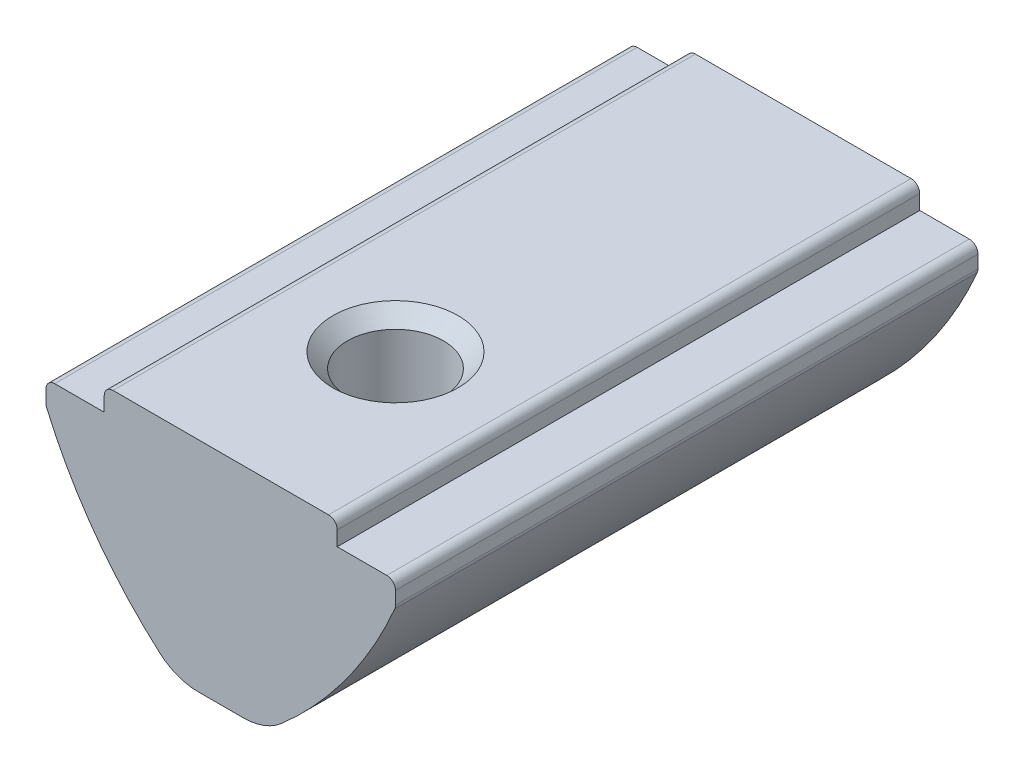
ISO-10303-21;
HEADER;
FILE_DESCRIPTION(('STEP AP214'),'2;1');
FILE_NAME('part.step','',(''),(''),'','','');
FILE_SCHEMA(('AUTOMOTIVE_DESIGN { 1 0 10303 214 1 1 1 1 }'));
ENDSEC;
DATA;
#1=APPLICATION_CONTEXT('core data for automotive mechanical design processes');
#2=APPLICATION_PROTOCOL_DEFINITION('international standard','automotive_design',2000,#1);
#3=PRODUCT_CONTEXT('',#1,'mechanical');
#4=PRODUCT('Part','Part','',(#3));
#5=PRODUCT_RELATED_PRODUCT_CATEGORY('part','',(#4));
#6=PRODUCT_DEFINITION_FORMATION('','',#4);
#7=PRODUCT_DEFINITION_CONTEXT('part definition',#1,'design');
#8=PRODUCT_DEFINITION('design','',#6,#7);
#9=PRODUCT_DEFINITION_SHAPE('','',#8);
#10=(LENGTH_UNIT() NAMED_UNIT(*) SI_UNIT(.MILLI.,.METRE.));
#11=(NAMED_UNIT(*) PLANE_ANGLE_UNIT() SI_UNIT($,.RADIAN.));
#12=(NAMED_UNIT(*) SI_UNIT($,.STERADIAN.) SOLID_ANGLE_UNIT());
#13=UNCERTAINTY_MEASURE_WITH_UNIT(LENGTH_MEASURE(1.E-05),#10,'distance_accuracy_value','');
#14=(GEOMETRIC_REPRESENTATION_CONTEXT(3) GLOBAL_UNCERTAINTY_ASSIGNED_CONTEXT((#13)) GLOBAL_UNIT_ASSIGNED_CONTEXT((#10,
#11,#12)) REPRESENTATION_CONTEXT('',''));
#15=CARTESIAN_POINT('',(0.,0.,0.));
#16=DIRECTION('',(0.,0.,1.));
#17=DIRECTION('',(1.,0.,0.));
#18=AXIS2_PLACEMENT_3D('',#15,#16,#17);
#19=CARTESIAN_POINT('',(-1.5,-7.5,10.));
#20=DIRECTION('',(0.,1.,0.));
#21=DIRECTION('',(0.,0.,1.));
#22=AXIS2_PLACEMENT_3D('',#19,#20,#21);
#23=PLANE('',#22);
#24=DIRECTION('',(0.,0.,-1.));
#25=VECTOR('',#24,1.);
#26=CARTESIAN_POINT('',(0.77644394282172,-7.5,10.));
#27=LINE('',#26,#25);
#28=CARTESIAN_POINT('',(0.77644394282172,-7.5,-10.));
#29=VERTEX_POINT('',#28);
#30=CARTESIAN_POINT('',(0.77644394282172,-7.5,-7.39897634134944));
#31=VERTEX_POINT('',#30);
#32=EDGE_CURVE('E207',#29,#31,#27,.F.);
#33=ORIENTED_EDGE('',*,*,#32,.T.);
#34=CARTESIAN_POINT('',(0.,-7.5,-6.));
#35=DIRECTION('',(0.,1.,0.));
#36=DIRECTION('',(0.,0.,1.));
#37=AXIS2_PLACEMENT_3D('',#34,#35,#36);
#38=CIRCLE('',#37,1.6);
#39=CARTESIAN_POINT('',(-0.77644394282172,-7.5,-7.39897634134944));
#40=VERTEX_POINT('',#39);
#41=EDGE_CURVE('E206',#31,#40,#38,.T.);
#42=ORIENTED_EDGE('',*,*,#41,.T.);
#43=DIRECTION('',(0.,0.,-1.));
#44=VECTOR('',#43,1.);
#45=CARTESIAN_POINT('',(-0.77644394282172,-7.5,10.));
#46=LINE('',#45,#44);
#47=CARTESIAN_POINT('',(-0.77644394282172,-7.5,-10.));
#48=VERTEX_POINT('',#47);
#49=EDGE_CURVE('E193',#40,#48,#46,.T.);
#50=ORIENTED_EDGE('',*,*,#49,.T.);
#51=DIRECTION('',(1.,0.,0.));
#52=VECTOR('',#51,1.);
#53=CARTESIAN_POINT('',(-1.5,-7.5,-10.));
#54=LINE('',#53,#52);
#55=EDGE_CURVE('E299',#48,#29,#54,.T.);
#56=ORIENTED_EDGE('',*,*,#55,.T.);
#57=EDGE_LOOP('',(#33,#42,#50,#56));
#58=FACE_BOUND('',#57,.T.);
#59=ADVANCED_FACE('F37',(#58),#23,.F.);
#60=CARTESIAN_POINT('',(-0.77644394282172,-7.5,2.54410343648477));
#61=VERTEX_POINT('',#60);
#62=CARTESIAN_POINT('',(-0.77644394282172,-7.5,-4.60102365865056));
#63=VERTEX_POINT('',#62);
#64=EDGE_CURVE('E201',#61,#63,#46,.T.);
#65=ORIENTED_EDGE('',*,*,#64,.T.);
#66=CARTESIAN_POINT('',(0.77644394282172,-7.5,-4.60102365865056));
#67=VERTEX_POINT('',#66);
#68=EDGE_CURVE('E58',#63,#67,#38,.T.);
#69=ORIENTED_EDGE('',*,*,#68,.T.);
#70=CARTESIAN_POINT('',(0.77644394282172,-7.5,2.54410343648477));
#71=VERTEX_POINT('',#70);
#72=EDGE_CURVE('E377',#67,#71,#27,.F.);
#73=ORIENTED_EDGE('',*,*,#72,.T.);
#74=CARTESIAN_POINT('',(0.,-7.5,4.));
#75=DIRECTION('',(0.,1.,0.));
#76=DIRECTION('',(0.,0.,1.));
#77=AXIS2_PLACEMENT_3D('',#74,#75,#76);
#78=CIRCLE('',#77,1.65);
#79=EDGE_CURVE('E252',#71,#61,#78,.T.);
#80=ORIENTED_EDGE('',*,*,#79,.T.);
#81=EDGE_LOOP('',(#65,#69,#73,#80));
#82=FACE_BOUND('',#81,.T.);
#83=ADVANCED_FACE('F397',(#82),#23,.F.);
#84=CARTESIAN_POINT('',(4.,0.,10.));
#85=DIRECTION('',(-1.,0.,0.));
#86=DIRECTION('',(0.,0.,1.));
#87=AXIS2_PLACEMENT_3D('',#84,#85,#86);
#88=PLANE('',#87);
#89=DIRECTION('',(0.,1.,0.));
#90=VECTOR('',#89,1.);
#91=CARTESIAN_POINT('',(4.,0.,-10.));
#92=LINE('',#91,#90);
#93=CARTESIAN_POINT('',(4.,-0.799999999999998,-10.));
#94=VERTEX_POINT('',#93);
#95=CARTESIAN_POINT('',(4.,-0.3,-10.));
#96=VERTEX_POINT('',#95);
#97=EDGE_CURVE('E251',#94,#96,#92,.T.);
#98=ORIENTED_EDGE('',*,*,#97,.T.);
#99=DIRECTION('',(0.,0.,-1.));
#100=VECTOR('',#99,1.);
#101=CARTESIAN_POINT('',(4.,-0.3,10.));
#102=LINE('',#101,#100);
#103=CARTESIAN_POINT('',(4.,-0.3,10.));
#104=VERTEX_POINT('',#103);
#105=EDGE_CURVE('E330',#96,#104,#102,.F.);
#106=ORIENTED_EDGE('',*,*,#105,.T.);
#107=DIRECTION('',(0.,1.,0.));
#108=VECTOR('',#107,1.);
#109=CARTESIAN_POINT('',(4.,0.,10.));
#110=LINE('',#109,#108);
#111=CARTESIAN_POINT('',(4.,-0.799999999999998,10.));
#112=VERTEX_POINT('',#111);
#113=EDGE_CURVE('E254',#112,#104,#110,.T.);
#114=ORIENTED_EDGE('',*,*,#113,.F.);
#115=DIRECTION('',(0.,0.,-1.));
#116=VECTOR('',#115,1.);
#117=CARTESIAN_POINT('',(4.,-0.799999999999998,10.));
#118=LINE('',#117,#116);
#119=EDGE_CURVE('E282',#112,#94,#118,.T.);
#120=ORIENTED_EDGE('',*,*,#119,.T.);
#121=EDGE_LOOP('',(#98,#106,#114,#120));
#122=FACE_BOUND('',#121,.T.);
#123=ADVANCED_FACE('F445',(#122),#88,.F.);
#124=CARTESIAN_POINT('',(-4.,0.,10.));
#125=DIRECTION('',(0.,-1.,0.));
#126=DIRECTION('',(0.,0.,-1.));
#127=AXIS2_PLACEMENT_3D('',#124,#125,#126);
#128=PLANE('',#127);
#129=CARTESIAN_POINT('',(0.,0.,4.));
#130=DIRECTION('',(0.,1.,0.));
#131=DIRECTION('',(0.,0.,1.));
#132=AXIS2_PLACEMENT_3D('',#129,#130,#131);
#133=CIRCLE('',#132,2.15);
#134=CARTESIAN_POINT('',(0.,0.,6.15));
#135=VERTEX_POINT('',#134);
#136=EDGE_CURVE('E217',#135,#135,#133,.T.);
#137=ORIENTED_EDGE('',*,*,#136,.F.);
#138=EDGE_LOOP('',(#137));
#139=FACE_BOUND('',#138,.T.);
#140=DIRECTION('',(-1.,0.,0.));
#141=VECTOR('',#140,1.);
#142=CARTESIAN_POINT('',(-4.,0.,10.));
#143=LINE('',#142,#141);
#144=CARTESIAN_POINT('',(3.7,0.,10.));
#145=VERTEX_POINT('',#144);
#146=CARTESIAN_POINT('',(-3.7,0.,10.));
#147=VERTEX_POINT('',#146);
#148=EDGE_CURVE('E257',#145,#147,#143,.T.);
#149=ORIENTED_EDGE('',*,*,#148,.F.);
#150=DIRECTION('',(0.,0.,-1.));
#151=VECTOR('',#150,1.);
#152=CARTESIAN_POINT('',(3.7,0.,10.));
#153=LINE('',#152,#151);
#154=CARTESIAN_POINT('',(3.7,0.,-10.));
#155=VERTEX_POINT('',#154);
#156=EDGE_CURVE('E314',#145,#155,#153,.T.);
#157=ORIENTED_EDGE('',*,*,#156,.T.);
#158=DIRECTION('',(-1.,0.,0.));
#159=VECTOR('',#158,1.);
#160=CARTESIAN_POINT('',(-4.,0.,-10.));
#161=LINE('',#160,#159);
#162=CARTESIAN_POINT('',(-3.7,0.,-10.));
#163=VERTEX_POINT('',#162);
#164=EDGE_CURVE('E285',#155,#163,#161,.T.);
#165=ORIENTED_EDGE('',*,*,#164,.T.);
#166=DIRECTION('',(0.,0.,-1.));
#167=VECTOR('',#166,1.);
#168=CARTESIAN_POINT('',(-3.7,0.,10.));
#169=LINE('',#168,#167);
#170=EDGE_CURVE('E312',#163,#147,#169,.F.);
#171=ORIENTED_EDGE('',*,*,#170,.T.);
#172=EDGE_LOOP('',(#149,#157,#165,#171));
#173=FACE_BOUND('',#172,.T.);
#174=ADVANCED_FACE('F434',(#139,#173),#128,.F.);
#175=CARTESIAN_POINT('',(-4.,0.,10.));
#176=DIRECTION('',(1.,0.,0.));
#177=DIRECTION('',(0.,0.,-1.));
#178=AXIS2_PLACEMENT_3D('',#175,#176,#177);
#179=PLANE('',#178);
#180=DIRECTION('',(0.,-1.,0.));
#181=VECTOR('',#180,1.);
#182=CARTESIAN_POINT('',(-4.,0.,10.));
#183=LINE('',#182,#181);
#184=CARTESIAN_POINT('',(-4.,-0.3,10.));
#185=VERTEX_POINT('',#184);
#186=CARTESIAN_POINT('',(-4.,-0.8,10.));
#187=VERTEX_POINT('',#186);
#188=EDGE_CURVE('E261',#185,#187,#183,.T.);
#189=ORIENTED_EDGE('',*,*,#188,.F.);
#190=DIRECTION('',(0.,0.,-1.));
#191=VECTOR('',#190,1.);
#192=CARTESIAN_POINT('',(-4.,-0.3,10.));
#193=LINE('',#192,#191);
#194=CARTESIAN_POINT('',(-4.,-0.3,-10.));
#195=VERTEX_POINT('',#194);
#196=EDGE_CURVE('E344',#185,#195,#193,.T.);
#197=ORIENTED_EDGE('',*,*,#196,.T.);
#198=DIRECTION('',(0.,-1.,0.));
#199=VECTOR('',#198,1.);
#200=CARTESIAN_POINT('',(-4.,0.,-10.));
#201=LINE('',#200,#199);
#202=CARTESIAN_POINT('',(-4.,-0.8,-10.));
#203=VERTEX_POINT('',#202);
#204=EDGE_CURVE('E288',#195,#203,#201,.T.);
#205=ORIENTED_EDGE('',*,*,#204,.T.);
#206=DIRECTION('',(0.,0.,-1.));
#207=VECTOR('',#206,1.);
#208=CARTESIAN_POINT('',(-4.,-0.8,10.));
#209=LINE('',#208,#207);
#210=EDGE_CURVE('E309',#187,#203,#209,.T.);
#211=ORIENTED_EDGE('',*,*,#210,.F.);
#212=EDGE_LOOP('',(#189,#197,#205,#211));
#213=FACE_BOUND('',#212,.T.);
#214=ADVANCED_FACE('F427',(#213),#179,.F.);
#215=CARTESIAN_POINT('',(-4.,-0.8,10.));
#216=DIRECTION('',(0.,-1.,0.));
#217=DIRECTION('',(1.,0.,0.));
#218=AXIS2_PLACEMENT_3D('',#215,#216,#217);
#219=PLANE('',#218);
#220=DIRECTION('',(-1.,0.,0.));
#221=VECTOR('',#220,1.);
#222=CARTESIAN_POINT('',(-4.,-0.8,-10.));
#223=LINE('',#222,#221);
#224=CARTESIAN_POINT('',(-5.7,-0.8,-10.));
#225=VERTEX_POINT('',#224);
#226=EDGE_CURVE('E290',#203,#225,#223,.T.);
#227=ORIENTED_EDGE('',*,*,#226,.T.);
#228=DIRECTION('',(0.,0.,-1.));
#229=VECTOR('',#228,1.);
#230=CARTESIAN_POINT('',(-5.7,-0.8,10.));
#231=LINE('',#230,#229);
#232=CARTESIAN_POINT('',(-5.7,-0.8,10.));
#233=VERTEX_POINT('',#232);
#234=EDGE_CURVE('E363',#225,#233,#231,.F.);
#235=ORIENTED_EDGE('',*,*,#234,.T.);
#236=DIRECTION('',(-1.,0.,0.));
#237=VECTOR('',#236,1.);
#238=CARTESIAN_POINT('',(-4.,-0.8,10.));
#239=LINE('',#238,#237);
#240=EDGE_CURVE('E263',#187,#233,#239,.T.);
#241=ORIENTED_EDGE('',*,*,#240,.F.);
#242=ORIENTED_EDGE('',*,*,#210,.T.);
#243=EDGE_LOOP('',(#227,#235,#241,#242));
#244=FACE_BOUND('',#243,.T.);
#245=ADVANCED_FACE('F422',(#244),#219,.F.);
#246=CARTESIAN_POINT('',(-6.,-0.8,10.));
#247=DIRECTION('',(1.,0.,0.));
#248=DIRECTION('',(0.,1.,0.));
#249=AXIS2_PLACEMENT_3D('',#246,#247,#248);
#250=PLANE('',#249);
#251=DIRECTION('',(0.,-1.,0.));
#252=VECTOR('',#251,1.);
#253=CARTESIAN_POINT('',(-6.,-0.8,10.));
#254=LINE('',#253,#252);
#255=CARTESIAN_POINT('',(-6.,-1.1,10.));
#256=VERTEX_POINT('',#255);
#257=CARTESIAN_POINT('',(-6.,-1.53860764081011,10.));
#258=VERTEX_POINT('',#257);
#259=EDGE_CURVE('E266',#256,#258,#254,.T.);
#260=ORIENTED_EDGE('',*,*,#259,.F.);
#261=DIRECTION('',(0.,0.,-1.));
#262=VECTOR('',#261,1.);
#263=CARTESIAN_POINT('',(-6.,-1.1,10.));
#264=LINE('',#263,#262);
#265=CARTESIAN_POINT('',(-6.,-1.1,-10.));
#266=VERTEX_POINT('',#265);
#267=EDGE_CURVE('E360',#256,#266,#264,.T.);
#268=ORIENTED_EDGE('',*,*,#267,.T.);
#269=DIRECTION('',(0.,-1.,0.));
#270=VECTOR('',#269,1.);
#271=CARTESIAN_POINT('',(-6.,-0.8,-10.));
#272=LINE('',#271,#270);
#273=CARTESIAN_POINT('',(-6.,-1.53860764081011,-10.));
#274=VERTEX_POINT('',#273);
#275=EDGE_CURVE('E293',#266,#274,#272,.T.);
#276=ORIENTED_EDGE('',*,*,#275,.T.);
#277=DIRECTION('',(0.,0.,-1.));
#278=VECTOR('',#277,1.);
#279=CARTESIAN_POINT('',(-6.,-1.53860764081011,10.));
#280=LINE('',#279,#278);
#281=EDGE_CURVE('E358',#274,#258,#280,.F.);
#282=ORIENTED_EDGE('',*,*,#281,.T.);
#283=EDGE_LOOP('',(#260,#268,#276,#282));
#284=FACE_BOUND('',#283,.T.);
#285=ADVANCED_FACE('F413',(#284),#250,.F.);
#286=CARTESIAN_POINT('',(7.80624784823439,4.26408734187369,10.));
#287=DIRECTION('',(0.,0.,-1.));
#288=DIRECTION('',(-1.,0.,0.));
#289=AXIS2_PLACEMENT_3D('',#286,#287,#288);
#290=CYLINDRICAL_SURFACE('',#289,15.);
#291=CARTESIAN_POINT('',(7.80624784823439,4.26408734187369,-10.));
#292=DIRECTION('',(0.,0.,1.));
#293=DIRECTION('',(1.,0.,0.));
#294=AXIS2_PLACEMENT_3D('',#291,#292,#293);
#295=CIRCLE('',#294,15.);
#296=CARTESIAN_POINT('',(-5.97563771118846,-1.6570299873955,-10.));
#297=VERTEX_POINT('',#296);
#298=CARTESIAN_POINT('',(-2.09685806452266,-7.00216728336518,-10.));
#299=VERTEX_POINT('',#298);
#300=EDGE_CURVE('E296',#297,#299,#295,.T.);
#301=ORIENTED_EDGE('',*,*,#300,.T.);
#302=DIRECTION('',(0.,0.,-1.));
#303=VECTOR('',#302,1.);
#304=CARTESIAN_POINT('',(-2.09685806452266,-7.00216728336518,10.));
#305=LINE('',#304,#303);
#306=CARTESIAN_POINT('',(-2.09685806452266,-7.00216728336518,10.));
#307=VERTEX_POINT('',#306);
#308=EDGE_CURVE('E380',#299,#307,#305,.F.);
#309=ORIENTED_EDGE('',*,*,#308,.T.);
#310=CARTESIAN_POINT('',(7.80624784823439,4.26408734187369,10.));
#311=DIRECTION('',(0.,0.,1.));
#312=DIRECTION('',(1.,0.,0.));
#313=AXIS2_PLACEMENT_3D('',#310,#311,#312);
#314=CIRCLE('',#313,15.);
#315=CARTESIAN_POINT('',(-5.97563771118846,-1.6570299873955,10.));
#316=VERTEX_POINT('',#315);
#317=EDGE_CURVE('E269',#316,#307,#314,.T.);
#318=ORIENTED_EDGE('',*,*,#317,.F.);
#319=DIRECTION('',(0.,0.,-1.));
#320=VECTOR('',#319,1.);
#321=CARTESIAN_POINT('',(-5.97563771118846,-1.6570299873955,10.));
#322=LINE('',#321,#320);
#323=EDGE_CURVE('E365',#316,#297,#322,.T.);
#324=ORIENTED_EDGE('',*,*,#323,.T.);
#325=EDGE_LOOP('',(#301,#309,#318,#324));
#326=FACE_BOUND('',#325,.T.);
#327=ADVANCED_FACE('F402',(#326),#290,.T.);
#328=CARTESIAN_POINT('',(-0.77644394282172,-7.5,10.));
#329=VERTEX_POINT('',#328);
#330=CARTESIAN_POINT('',(-0.77644394282172,-7.5,5.45589656351523));
#331=VERTEX_POINT('',#330);
#332=EDGE_CURVE('E204',#329,#331,#46,.T.);
#333=ORIENTED_EDGE('',*,*,#332,.T.);
#334=CARTESIAN_POINT('',(0.77644394282172,-7.5,5.45589656351523));
#335=VERTEX_POINT('',#334);
#336=EDGE_CURVE('E253',#331,#335,#78,.T.);
#337=ORIENTED_EDGE('',*,*,#336,.T.);
#338=CARTESIAN_POINT('',(0.77644394282172,-7.5,10.));
#339=VERTEX_POINT('',#338);
#340=EDGE_CURVE('E374',#335,#339,#27,.F.);
#341=ORIENTED_EDGE('',*,*,#340,.T.);
#342=DIRECTION('',(1.,0.,0.));
#343=VECTOR('',#342,1.);
#344=CARTESIAN_POINT('',(-1.5,-7.5,10.));
#345=LINE('',#344,#343);
#346=EDGE_CURVE('E272',#329,#339,#345,.T.);
#347=ORIENTED_EDGE('',*,*,#346,.F.);
#348=EDGE_LOOP('',(#333,#337,#341,#347));
#349=FACE_BOUND('',#348,.T.);
#350=ADVANCED_FACE('F391',(#349),#23,.F.);
#351=CARTESIAN_POINT('',(-7.80624784823439,4.26408734187369,10.));
#352=DIRECTION('',(0.,0.,-1.));
#353=DIRECTION('',(-1.,0.,0.));
#354=AXIS2_PLACEMENT_3D('',#351,#352,#353);
#355=CYLINDRICAL_SURFACE('',#354,15.);
#356=CARTESIAN_POINT('',(-7.80624784823439,4.26408734187369,10.));
#357=DIRECTION('',(0.,0.,1.));
#358=DIRECTION('',(1.,0.,0.));
#359=AXIS2_PLACEMENT_3D('',#356,#357,#358);
#360=CIRCLE('',#359,15.);
#361=CARTESIAN_POINT('',(2.09685806452266,-7.00216728336518,10.));
#362=VERTEX_POINT('',#361);
#363=CARTESIAN_POINT('',(5.97563771118846,-1.6570299873955,10.));
#364=VERTEX_POINT('',#363);
#365=EDGE_CURVE('E275',#362,#364,#360,.T.);
#366=ORIENTED_EDGE('',*,*,#365,.F.);
#367=DIRECTION('',(0.,0.,-1.));
#368=VECTOR('',#367,1.);
#369=CARTESIAN_POINT('',(2.09685806452266,-7.00216728336518,10.));
#370=LINE('',#369,#368);
#371=CARTESIAN_POINT('',(2.09685806452266,-7.00216728336518,-10.));
#372=VERTEX_POINT('',#371);
#373=EDGE_CURVE('E368',#362,#372,#370,.T.);
#374=ORIENTED_EDGE('',*,*,#373,.T.);
#375=CARTESIAN_POINT('',(-7.80624784823439,4.26408734187369,-10.));
#376=DIRECTION('',(0.,0.,1.));
#377=DIRECTION('',(1.,0.,0.));
#378=AXIS2_PLACEMENT_3D('',#375,#376,#377);
#379=CIRCLE('',#378,15.);
#380=CARTESIAN_POINT('',(5.97563771118846,-1.6570299873955,-10.));
#381=VERTEX_POINT('',#380);
#382=EDGE_CURVE('E301',#372,#381,#379,.T.);
#383=ORIENTED_EDGE('',*,*,#382,.T.);
#384=DIRECTION('',(0.,0.,-1.));
#385=VECTOR('',#384,1.);
#386=CARTESIAN_POINT('',(5.97563771118846,-1.6570299873955,10.));
#387=LINE('',#386,#385);
#388=EDGE_CURVE('E352',#381,#364,#387,.F.);
#389=ORIENTED_EDGE('',*,*,#388,.T.);
#390=EDGE_LOOP('',(#366,#374,#383,#389));
#391=FACE_BOUND('',#390,.T.);
#392=ADVANCED_FACE('F467',(#391),#355,.T.);
#393=CARTESIAN_POINT('',(6.,-0.799999999999998,10.));
#394=DIRECTION('',(-1.,0.,0.));
#395=DIRECTION('',(0.,-1.,0.));
#396=AXIS2_PLACEMENT_3D('',#393,#394,#395);
#397=PLANE('',#396);
#398=DIRECTION('',(0.,1.,0.));
#399=VECTOR('',#398,1.);
#400=CARTESIAN_POINT('',(6.,-0.799999999999998,10.));
#401=LINE('',#400,#399);
#402=CARTESIAN_POINT('',(6.,-1.53860764081011,10.));
#403=VERTEX_POINT('',#402);
#404=CARTESIAN_POINT('',(6.,-1.1,10.));
#405=VERTEX_POINT('',#404);
#406=EDGE_CURVE('E277',#403,#405,#401,.T.);
#407=ORIENTED_EDGE('',*,*,#406,.F.);
#408=DIRECTION('',(0.,0.,-1.));
#409=VECTOR('',#408,1.);
#410=CARTESIAN_POINT('',(6.,-1.53860764081011,10.));
#411=LINE('',#410,#409);
#412=CARTESIAN_POINT('',(6.,-1.53860764081011,-10.));
#413=VERTEX_POINT('',#412);
#414=EDGE_CURVE('E349',#403,#413,#411,.T.);
#415=ORIENTED_EDGE('',*,*,#414,.T.);
#416=DIRECTION('',(0.,1.,0.));
#417=VECTOR('',#416,1.);
#418=CARTESIAN_POINT('',(6.,-0.799999999999998,-10.));
#419=LINE('',#418,#417);
#420=CARTESIAN_POINT('',(6.,-1.1,-10.));
#421=VERTEX_POINT('',#420);
#422=EDGE_CURVE('E303',#413,#421,#419,.T.);
#423=ORIENTED_EDGE('',*,*,#422,.T.);
#424=DIRECTION('',(0.,0.,-1.));
#425=VECTOR('',#424,1.);
#426=CARTESIAN_POINT('',(6.,-1.1,10.));
#427=LINE('',#426,#425);
#428=EDGE_CURVE('E347',#421,#405,#427,.F.);
#429=ORIENTED_EDGE('',*,*,#428,.T.);
#430=EDGE_LOOP('',(#407,#415,#423,#429));
#431=FACE_BOUND('',#430,.T.);
#432=ADVANCED_FACE('F457',(#431),#397,.F.);
#433=CARTESIAN_POINT('',(4.,-0.799999999999998,10.));
#434=DIRECTION('',(0.,-1.,0.));
#435=DIRECTION('',(1.,0.,0.));
#436=AXIS2_PLACEMENT_3D('',#433,#434,#435);
#437=PLANE('',#436);
#438=DIRECTION('',(-1.,0.,0.));
#439=VECTOR('',#438,1.);
#440=CARTESIAN_POINT('',(4.,-0.799999999999998,10.));
#441=LINE('',#440,#439);
#442=CARTESIAN_POINT('',(5.7,-0.799999999999998,10.));
#443=VERTEX_POINT('',#442);
#444=EDGE_CURVE('E280',#443,#112,#441,.T.);
#445=ORIENTED_EDGE('',*,*,#444,.F.);
#446=DIRECTION('',(0.,0.,-1.));
#447=VECTOR('',#446,1.);
#448=CARTESIAN_POINT('',(5.7,-0.799999999999998,10.));
#449=LINE('',#448,#447);
#450=CARTESIAN_POINT('',(5.7,-0.799999999999998,-10.));
#451=VERTEX_POINT('',#450);
#452=EDGE_CURVE('E355',#443,#451,#449,.T.);
#453=ORIENTED_EDGE('',*,*,#452,.T.);
#454=DIRECTION('',(-1.,0.,0.));
#455=VECTOR('',#454,1.);
#456=CARTESIAN_POINT('',(4.,-0.799999999999998,-10.));
#457=LINE('',#456,#455);
#458=EDGE_CURVE('E258',#451,#94,#457,.T.);
#459=ORIENTED_EDGE('',*,*,#458,.T.);
#460=ORIENTED_EDGE('',*,*,#119,.F.);
#461=EDGE_LOOP('',(#445,#453,#459,#460));
#462=FACE_BOUND('',#461,.T.);
#463=ADVANCED_FACE('F450',(#462),#437,.F.);
#464=CARTESIAN_POINT('',(-7.80624784823439,4.26408734187369,10.));
#465=DIRECTION('',(0.,0.,1.));
#466=DIRECTION('',(1.,0.,0.));
#467=AXIS2_PLACEMENT_3D('',#464,#465,#466);
#468=PLANE('',#467);
#469=ORIENTED_EDGE('',*,*,#346,.T.);
#470=CARTESIAN_POINT('',(0.77644394282172,-5.5,10.));
#471=DIRECTION('',(0.,0.,1.));
#472=DIRECTION('',(1.,0.,0.));
#473=AXIS2_PLACEMENT_3D('',#470,#471,#472);
#474=CIRCLE('',#473,2.);
#475=EDGE_CURVE('E379',#339,#362,#474,.T.);
#476=ORIENTED_EDGE('',*,*,#475,.T.);
#477=ORIENTED_EDGE('',*,*,#365,.T.);
#478=CARTESIAN_POINT('',(5.7,-1.53860764081011,10.));
#479=DIRECTION('',(0.,0.,1.));
#480=DIRECTION('',(1.,0.,0.));
#481=AXIS2_PLACEMENT_3D('',#478,#479,#480);
#482=CIRCLE('',#481,0.3);
#483=EDGE_CURVE('E338',#364,#403,#482,.T.);
#484=ORIENTED_EDGE('',*,*,#483,.T.);
#485=ORIENTED_EDGE('',*,*,#406,.T.);
#486=CARTESIAN_POINT('',(5.7,-1.1,10.));
#487=DIRECTION('',(0.,0.,1.));
#488=DIRECTION('',(1.,0.,0.));
#489=AXIS2_PLACEMENT_3D('',#486,#487,#488);
#490=CIRCLE('',#489,0.3);
#491=EDGE_CURVE('E336',#405,#443,#490,.T.);
#492=ORIENTED_EDGE('',*,*,#491,.T.);
#493=ORIENTED_EDGE('',*,*,#444,.T.);
#494=ORIENTED_EDGE('',*,*,#113,.T.);
#495=CARTESIAN_POINT('',(3.7,-0.3,10.));
#496=DIRECTION('',(0.,0.,1.));
#497=DIRECTION('',(1.,0.,0.));
#498=AXIS2_PLACEMENT_3D('',#495,#496,#497);
#499=CIRCLE('',#498,0.3);
#500=EDGE_CURVE('E342',#104,#145,#499,.T.);
#501=ORIENTED_EDGE('',*,*,#500,.T.);
#502=ORIENTED_EDGE('',*,*,#148,.T.);
#503=CARTESIAN_POINT('',(-3.7,-0.3,10.));
#504=DIRECTION('',(0.,0.,1.));
#505=DIRECTION('',(1.,0.,0.));
#506=AXIS2_PLACEMENT_3D('',#503,#504,#505);
#507=CIRCLE('',#506,0.3);
#508=EDGE_CURVE('E340',#147,#185,#507,.T.);
#509=ORIENTED_EDGE('',*,*,#508,.T.);
#510=ORIENTED_EDGE('',*,*,#188,.T.);
#511=ORIENTED_EDGE('',*,*,#240,.T.);
#512=CARTESIAN_POINT('',(-5.7,-1.1,10.));
#513=DIRECTION('',(0.,0.,1.));
#514=DIRECTION('',(1.,0.,0.));
#515=AXIS2_PLACEMENT_3D('',#512,#513,#514);
#516=CIRCLE('',#515,0.3);
#517=EDGE_CURVE('E334',#233,#256,#516,.T.);
#518=ORIENTED_EDGE('',*,*,#517,.T.);
#519=ORIENTED_EDGE('',*,*,#259,.T.);
#520=CARTESIAN_POINT('',(-5.7,-1.53860764081011,10.));
#521=DIRECTION('',(0.,0.,1.));
#522=DIRECTION('',(1.,0.,0.));
#523=AXIS2_PLACEMENT_3D('',#520,#521,#522);
#524=CIRCLE('',#523,0.3);
#525=EDGE_CURVE('E332',#258,#316,#524,.T.);
#526=ORIENTED_EDGE('',*,*,#525,.T.);
#527=ORIENTED_EDGE('',*,*,#317,.T.);
#528=CARTESIAN_POINT('',(-0.77644394282172,-5.5,10.));
#529=DIRECTION('',(0.,0.,1.));
#530=DIRECTION('',(1.,0.,0.));
#531=AXIS2_PLACEMENT_3D('',#528,#529,#530);
#532=CIRCLE('',#531,2.);
#533=EDGE_CURVE('E376',#307,#329,#532,.T.);
#534=ORIENTED_EDGE('',*,*,#533,.T.);
#535=EDGE_LOOP('',(#469,#476,#477,#484,#485,#492,#493,#494,#501,#502,#509,#510,#511,#518,#519,
#526,#527,#534));
#536=FACE_BOUND('',#535,.T.);
#537=ADVANCED_FACE('F235',(#536),#468,.T.);
#538=CARTESIAN_POINT('',(-7.80624784823439,4.26408734187369,-10.));
#539=DIRECTION('',(0.,0.,1.));
#540=DIRECTION('',(1.,0.,0.));
#541=AXIS2_PLACEMENT_3D('',#538,#539,#540);
#542=PLANE('',#541);
#543=ORIENTED_EDGE('',*,*,#382,.F.);
#544=CARTESIAN_POINT('',(0.77644394282172,-5.5,-10.));
#545=DIRECTION('',(0.,0.,1.));
#546=DIRECTION('',(1.,0.,0.));
#547=AXIS2_PLACEMENT_3D('',#544,#545,#546);
#548=CIRCLE('',#547,2.);
#549=EDGE_CURVE('E202',#372,#29,#548,.F.);
#550=ORIENTED_EDGE('',*,*,#549,.T.);
#551=ORIENTED_EDGE('',*,*,#55,.F.);
#552=CARTESIAN_POINT('',(-0.77644394282172,-5.5,-10.));
#553=DIRECTION('',(0.,0.,1.));
#554=DIRECTION('',(1.,0.,0.));
#555=AXIS2_PLACEMENT_3D('',#552,#553,#554);
#556=CIRCLE('',#555,2.);
#557=EDGE_CURVE('E197',#48,#299,#556,.F.);
#558=ORIENTED_EDGE('',*,*,#557,.T.);
#559=ORIENTED_EDGE('',*,*,#300,.F.);
#560=CARTESIAN_POINT('',(-5.7,-1.53860764081011,-10.));
#561=DIRECTION('',(0.,0.,1.));
#562=DIRECTION('',(1.,0.,0.));
#563=AXIS2_PLACEMENT_3D('',#560,#561,#562);
#564=CIRCLE('',#563,0.3);
#565=EDGE_CURVE('E317',#297,#274,#564,.F.);
#566=ORIENTED_EDGE('',*,*,#565,.T.);
#567=ORIENTED_EDGE('',*,*,#275,.F.);
#568=CARTESIAN_POINT('',(-5.7,-1.1,-10.));
#569=DIRECTION('',(0.,0.,1.));
#570=DIRECTION('',(1.,0.,0.));
#571=AXIS2_PLACEMENT_3D('',#568,#569,#570);
#572=CIRCLE('',#571,0.3);
#573=EDGE_CURVE('E319',#266,#225,#572,.F.);
#574=ORIENTED_EDGE('',*,*,#573,.T.);
#575=ORIENTED_EDGE('',*,*,#226,.F.);
#576=ORIENTED_EDGE('',*,*,#204,.F.);
#577=CARTESIAN_POINT('',(-3.7,-0.3,-10.));
#578=DIRECTION('',(0.,0.,1.));
#579=DIRECTION('',(1.,0.,0.));
#580=AXIS2_PLACEMENT_3D('',#577,#578,#579);
#581=CIRCLE('',#580,0.3);
#582=EDGE_CURVE('E326',#195,#163,#581,.F.);
#583=ORIENTED_EDGE('',*,*,#582,.T.);
#584=ORIENTED_EDGE('',*,*,#164,.F.);
#585=CARTESIAN_POINT('',(3.7,-0.3,-10.));
#586=DIRECTION('',(0.,0.,1.));
#587=DIRECTION('',(1.,0.,0.));
#588=AXIS2_PLACEMENT_3D('',#585,#586,#587);
#589=CIRCLE('',#588,0.3);
#590=EDGE_CURVE('E328',#155,#96,#589,.F.);
#591=ORIENTED_EDGE('',*,*,#590,.T.);
#592=ORIENTED_EDGE('',*,*,#97,.F.);
#593=ORIENTED_EDGE('',*,*,#458,.F.);
#594=CARTESIAN_POINT('',(5.7,-1.1,-10.));
#595=DIRECTION('',(0.,0.,1.));
#596=DIRECTION('',(1.,0.,0.));
#597=AXIS2_PLACEMENT_3D('',#594,#595,#596);
#598=CIRCLE('',#597,0.3);
#599=EDGE_CURVE('E321',#451,#421,#598,.F.);
#600=ORIENTED_EDGE('',*,*,#599,.T.);
#601=ORIENTED_EDGE('',*,*,#422,.F.);
#602=CARTESIAN_POINT('',(5.7,-1.53860764081011,-10.));
#603=DIRECTION('',(0.,0.,1.));
#604=DIRECTION('',(1.,0.,0.));
#605=AXIS2_PLACEMENT_3D('',#602,#603,#604);
#606=CIRCLE('',#605,0.3);
#607=EDGE_CURVE('E323',#413,#381,#606,.F.);
#608=ORIENTED_EDGE('',*,*,#607,.T.);
#609=EDGE_LOOP('',(#543,#550,#551,#558,#559,#566,#567,#574,#575,#576,#583,#584,#591,#592,#593,
#600,#601,#608));
#610=FACE_BOUND('',#609,.T.);
#611=ADVANCED_FACE('F410',(#610),#542,.F.);
#612=CARTESIAN_POINT('',(3.7,-0.3,10.));
#613=DIRECTION('',(0.,0.,-1.));
#614=DIRECTION('',(-1.,0.,0.));
#615=AXIS2_PLACEMENT_3D('',#612,#613,#614);
#616=CYLINDRICAL_SURFACE('',#615,0.3);
#617=ORIENTED_EDGE('',*,*,#500,.F.);
#618=ORIENTED_EDGE('',*,*,#105,.F.);
#619=ORIENTED_EDGE('',*,*,#590,.F.);
#620=ORIENTED_EDGE('',*,*,#156,.F.);
#621=EDGE_LOOP('',(#617,#618,#619,#620));
#622=FACE_BOUND('',#621,.T.);
#623=ADVANCED_FACE('F440',(#622),#616,.T.);
#624=CARTESIAN_POINT('',(-3.7,-0.3,10.));
#625=DIRECTION('',(0.,0.,-1.));
#626=DIRECTION('',(-1.,0.,0.));
#627=AXIS2_PLACEMENT_3D('',#624,#625,#626);
#628=CYLINDRICAL_SURFACE('',#627,0.3);
#629=ORIENTED_EDGE('',*,*,#508,.F.);
#630=ORIENTED_EDGE('',*,*,#170,.F.);
#631=ORIENTED_EDGE('',*,*,#582,.F.);
#632=ORIENTED_EDGE('',*,*,#196,.F.);
#633=EDGE_LOOP('',(#629,#630,#631,#632));
#634=FACE_BOUND('',#633,.T.);
#635=ADVANCED_FACE('F437',(#634),#628,.T.);
#636=CARTESIAN_POINT('',(5.7,-1.53860764081011,10.));
#637=DIRECTION('',(0.,0.,-1.));
#638=DIRECTION('',(-1.,0.,0.));
#639=AXIS2_PLACEMENT_3D('',#636,#637,#638);
#640=CYLINDRICAL_SURFACE('',#639,0.3);
#641=ORIENTED_EDGE('',*,*,#483,.F.);
#642=ORIENTED_EDGE('',*,*,#388,.F.);
#643=ORIENTED_EDGE('',*,*,#607,.F.);
#644=ORIENTED_EDGE('',*,*,#414,.F.);
#645=EDGE_LOOP('',(#641,#642,#643,#644));
#646=FACE_BOUND('',#645,.T.);
#647=ADVANCED_FACE('F463',(#646),#640,.T.);
#648=CARTESIAN_POINT('',(5.7,-1.1,10.));
#649=DIRECTION('',(0.,0.,-1.));
#650=DIRECTION('',(-1.,0.,0.));
#651=AXIS2_PLACEMENT_3D('',#648,#649,#650);
#652=CYLINDRICAL_SURFACE('',#651,0.3);
#653=ORIENTED_EDGE('',*,*,#491,.F.);
#654=ORIENTED_EDGE('',*,*,#428,.F.);
#655=ORIENTED_EDGE('',*,*,#599,.F.);
#656=ORIENTED_EDGE('',*,*,#452,.F.);
#657=EDGE_LOOP('',(#653,#654,#655,#656));
#658=FACE_BOUND('',#657,.T.);
#659=ADVANCED_FACE('F460',(#658),#652,.T.);
#660=CARTESIAN_POINT('',(-5.7,-1.1,10.));
#661=DIRECTION('',(0.,0.,-1.));
#662=DIRECTION('',(-1.,0.,0.));
#663=AXIS2_PLACEMENT_3D('',#660,#661,#662);
#664=CYLINDRICAL_SURFACE('',#663,0.3);
#665=ORIENTED_EDGE('',*,*,#517,.F.);
#666=ORIENTED_EDGE('',*,*,#234,.F.);
#667=ORIENTED_EDGE('',*,*,#573,.F.);
#668=ORIENTED_EDGE('',*,*,#267,.F.);
#669=EDGE_LOOP('',(#665,#666,#667,#668));
#670=FACE_BOUND('',#669,.T.);
#671=ADVANCED_FACE('F417',(#670),#664,.T.);
#672=CARTESIAN_POINT('',(-5.7,-1.53860764081011,10.));
#673=DIRECTION('',(0.,0.,-1.));
#674=DIRECTION('',(-1.,0.,0.));
#675=AXIS2_PLACEMENT_3D('',#672,#673,#674);
#676=CYLINDRICAL_SURFACE('',#675,0.3);
#677=ORIENTED_EDGE('',*,*,#525,.F.);
#678=ORIENTED_EDGE('',*,*,#281,.F.);
#679=ORIENTED_EDGE('',*,*,#565,.F.);
#680=ORIENTED_EDGE('',*,*,#323,.F.);
#681=EDGE_LOOP('',(#677,#678,#679,#680));
#682=FACE_BOUND('',#681,.T.);
#683=ADVANCED_FACE('F405',(#682),#676,.T.);
#684=CARTESIAN_POINT('',(0.77644394282172,-5.5,10.));
#685=DIRECTION('',(0.,0.,-1.));
#686=DIRECTION('',(-1.,0.,0.));
#687=AXIS2_PLACEMENT_3D('',#684,#685,#686);
#688=CYLINDRICAL_SURFACE('',#687,2.);
#689=CARTESIAN_POINT('',(0.77624394282172,-7.49999999,-7.39908733295409));
#690=CARTESIAN_POINT('',(0.823888907795322,-7.5000163662139,-7.37264542572982));
#691=CARTESIAN_POINT('',(0.870798730630545,-7.49830726234882,-7.34489502857416));
#692=CARTESIAN_POINT('',(0.962717315036726,-7.49183657407774,-7.2867264015147));
#693=CARTESIAN_POINT('',(1.0077260427266,-7.48707493529428,-7.25630812409397));
#694=CARTESIAN_POINT('',(1.0959110921607,-7.47482808508022,-7.19239057510038));
#695=CARTESIAN_POINT('',(1.13906058626592,-7.4673123624851,-7.15886005919068));
#696=CARTESIAN_POINT('',(1.22250181673807,-7.4500905430944,-7.08895372196665));
#697=CARTESIAN_POINT('',(1.26279368231908,-7.44038454542012,-7.05257802945995));
#698=CARTESIAN_POINT('',(1.37892430125021,-7.40877391489258,-6.93881943965529));
#699=CARTESIAN_POINT('',(1.44982822654987,-7.38440710940906,-6.85693898652386));
#700=CARTESIAN_POINT('',(1.57354123819966,-7.3354966378064,-6.68099673127559));
#701=CARTESIAN_POINT('',(1.6264693454646,-7.31095527899559,-6.58702097024805));
#702=CARTESIAN_POINT('',(1.69215248989433,-7.27826738931791,-6.4287326320823));
#703=CARTESIAN_POINT('',(1.71247804926022,-7.2675280679395,-6.36810212074399));
#704=CARTESIAN_POINT('',(1.74389831934219,-7.25052986041667,-6.24387517106553));
#705=CARTESIAN_POINT('',(1.75500247468365,-7.24426639099372,-6.18028183796674));
#706=CARTESIAN_POINT('',(1.76716152938497,-7.23739293100954,-6.05149182770862));
#707=CARTESIAN_POINT('',(1.76816667157315,-7.23681093308248,-5.98628879703286));
#708=CARTESIAN_POINT('',(1.75990866552184,-7.24149821482215,-5.85674253850229));
#709=CARTESIAN_POINT('',(1.7506409738932,-7.24677008349333,-5.79239970383038));
#710=CARTESIAN_POINT('',(1.72342839957346,-7.26165745476622,-5.67023558455453));
#711=CARTESIAN_POINT('',(1.70603176652634,-7.27099628105936,-5.61225395888941));
#712=CARTESIAN_POINT('',(1.66381958824499,-7.29251936403575,-5.49965360823224));
#713=CARTESIAN_POINT('',(1.63900094313407,-7.30470480917124,-5.44503629989783));
#714=CARTESIAN_POINT('',(1.56726801843416,-7.33763154056192,-5.31002913357287));
#715=CARTESIAN_POINT('',(1.51576068341344,-7.35934509079095,-5.23231830208072));
#716=CARTESIAN_POINT('',(1.4003783513937,-7.40117965250356,-5.08593672076177));
#717=CARTESIAN_POINT('',(1.33646013382005,-7.42129474199644,-5.01729901420212));
#718=CARTESIAN_POINT('',(1.23118790272236,-7.44798568407113,-4.91883811502684));
#719=CARTESIAN_POINT('',(1.19321624352198,-7.45650030704662,-4.88584404305152));
#720=CARTESIAN_POINT('',(1.11491053969296,-7.47155445418425,-4.82227642605349));
#721=CARTESIAN_POINT('',(1.07457630166353,-7.47809381638093,-4.79170307967461));
#722=CARTESIAN_POINT('',(0.992148835887978,-7.48876531240439,-4.73309487677873));
#723=CARTESIAN_POINT('',(0.950066811240351,-7.49291081433173,-4.70504667631864));
#724=CARTESIAN_POINT('',(0.864283149079416,-7.49853473621165,-4.65125848500325));
#725=CARTESIAN_POINT('',(0.820581560156109,-7.50001323611334,-4.62551842497848));
#726=CARTESIAN_POINT('',(0.776243942821723,-7.49999999000001,-4.60091266704591));
#727=B_SPLINE_CURVE_WITH_KNOTS('',3,(#689,#690,#691,#692,#693,#694,#695,#696,#697,#698,#699,
#700,#701,#702,#703,#704,#705,#706,#707,#708,#709,#710,#711,#712,#713,#714,#715,#716,#717,#718,
#719,#720,#721,#722,#723,#724,#725,#726),.UNSPECIFIED.,.F.,.F.,(4,2,2,2,2,2,2,2,2,2,2,2,2,2,2,2,
2,2,4),(0.,0.163411533222596,0.326825977518133,0.492108424718467,0.657383393531388,
0.988627430471472,1.31763341861502,1.51142378927634,1.70501543285838,1.899560424722,
2.09419149277645,2.27725899246955,2.4604030591533,2.74602323733678,3.03265652224181,
3.18558675269292,3.33852951956205,3.49060973202143,3.64268538547384),.UNSPECIFIED.);
#728=EDGE_CURVE('E65',#31,#67,#727,.T.);
#729=ORIENTED_EDGE('',*,*,#728,.F.);
#730=ORIENTED_EDGE('',*,*,#32,.F.);
#731=ORIENTED_EDGE('',*,*,#549,.F.);
#732=ORIENTED_EDGE('',*,*,#373,.F.);
#733=ORIENTED_EDGE('',*,*,#475,.F.);
#734=ORIENTED_EDGE('',*,*,#340,.F.);
#735=CARTESIAN_POINT('',(0.77644394282172,-7.5,2.54410343648477));
#736=CARTESIAN_POINT('',(0.815792561825164,-7.50000326555687,2.56508445015834));
#737=CARTESIAN_POINT('',(0.85425347327921,-7.4988385143258,2.58764959419889));
#738=CARTESIAN_POINT('',(0.929113685083301,-7.49451587924962,2.63573347439856));
#739=CARTESIAN_POINT('',(0.965514995502466,-7.49135997655152,2.66124925416148));
#740=CARTESIAN_POINT('',(1.07092755392083,-7.47945875027511,2.7416723154491));
#741=CARTESIAN_POINT('',(1.13658567260522,-7.46827233538824,2.8006905550356));
#742=CARTESIAN_POINT('',(1.257112158881,-7.44235914631729,2.92769974083234));
#743=CARTESIAN_POINT('',(1.31201469243218,-7.4276439242243,2.99566108940712));
#744=CARTESIAN_POINT('',(1.41047786587965,-7.39753906685589,3.13939004275118));
#745=CARTESIAN_POINT('',(1.45401959859575,-7.38214835649401,3.21517037149413));
#746=CARTESIAN_POINT('',(1.53154940818727,-7.35247815868379,3.37897748729223));
#747=CARTESIAN_POINT('',(1.56457226128611,-7.33836938914189,3.46749669658487));
#748=CARTESIAN_POINT('',(1.61509807873093,-7.31588550103843,3.64949900946778));
#749=CARTESIAN_POINT('',(1.63262114627432,-7.30750295879381,3.74297551606822));
#750=CARTESIAN_POINT('',(1.65076006401833,-7.29879612661771,3.92620593837946));
#751=CARTESIAN_POINT('',(1.65233547948478,-7.29801460522971,4.01584250367262));
#752=CARTESIAN_POINT('',(1.64098800982412,-7.30349673158703,4.1939678745944));
#753=CARTESIAN_POINT('',(1.62806441514391,-7.30976072412602,4.28245662383678));
#754=CARTESIAN_POINT('',(1.58947225940444,-7.32740130006477,4.45067483407396));
#755=CARTESIAN_POINT('',(1.56456844738944,-7.33846763142647,4.53061641458725));
#756=CARTESIAN_POINT('',(1.50318639560808,-7.36358289410051,4.68547578344222));
#757=CARTESIAN_POINT('',(1.46669755392287,-7.37763455349225,4.76038889365879));
#758=CARTESIAN_POINT('',(1.3790473476187,-7.40767089500951,4.91047799957459));
#759=CARTESIAN_POINT('',(1.32683716731151,-7.42371382726207,4.9850307575216));
#760=CARTESIAN_POINT('',(1.21063879159949,-7.45321619098235,5.12475971176757));
#761=CARTESIAN_POINT('',(1.14667190421399,-7.46668020777588,5.18995249745903));
#762=CARTESIAN_POINT('',(1.0315590331407,-7.48420589806895,5.28921100559127));
#763=CARTESIAN_POINT('',(0.983317231570373,-7.48990661100635,5.32637944886722));
#764=CARTESIAN_POINT('',(0.882768974003261,-7.4978128953235,5.3953336748091));
#765=CARTESIAN_POINT('',(0.830456559885076,-7.50001323832459,5.42711134233998));
#766=CARTESIAN_POINT('',(0.77644394282172,-7.5,5.45589656351523));
#767=B_SPLINE_CURVE_WITH_KNOTS('',3,(#735,#736,#737,#738,#739,#740,#741,#742,#743,#744,#745,
#746,#747,#748,#749,#750,#751,#752,#753,#754,#755,#756,#757,#758,#759,#760,#761,#762,#763,#764,
#765,#766),.UNSPECIFIED.,.F.,.F.,(4,2,2,2,2,2,2,2,2,2,2,2,2,2,2,4),(0.,0.133661047358344,
0.267189314515782,0.532775246163271,0.797503333500748,1.0626692234409,1.34778478649564,
1.63253001057844,1.9000324067936,2.16754789462249,2.41988468403633,2.67245306568137,
2.94850592069882,3.22406330099154,3.40712115687471,3.59045218393223),.UNSPECIFIED.);
#768=EDGE_CURVE('E51',#71,#335,#767,.T.);
#769=ORIENTED_EDGE('',*,*,#768,.F.);
#770=ORIENTED_EDGE('',*,*,#72,.F.);
#771=EDGE_LOOP('',(#729,#730,#731,#732,#733,#734,#769,#770));
#772=FACE_BOUND('',#771,.T.);
#773=ADVANCED_FACE('F219',(#772),#688,.T.);
#774=CARTESIAN_POINT('',(-0.77644394282172,-5.5,10.));
#775=DIRECTION('',(0.,0.,-1.));
#776=DIRECTION('',(-1.,0.,0.));
#777=AXIS2_PLACEMENT_3D('',#774,#775,#776);
#778=CYLINDRICAL_SURFACE('',#777,2.);
#779=CARTESIAN_POINT('',(-0.77624394282172,-7.49999999,-4.60091266704591));
#780=CARTESIAN_POINT('',(-0.823888907795322,-7.5000163662139,-4.62735457427018));
#781=CARTESIAN_POINT('',(-0.870798730630545,-7.49830726234882,-4.65510497142584));
#782=CARTESIAN_POINT('',(-0.962717315036726,-7.49183657407774,-4.7132735984853));
#783=CARTESIAN_POINT('',(-1.0077260427266,-7.48707493529428,-4.74369187590603));
#784=CARTESIAN_POINT('',(-1.0959110921607,-7.47482808508022,-4.80760942489962));
#785=CARTESIAN_POINT('',(-1.13906058626592,-7.4673123624851,-4.84113994080932));
#786=CARTESIAN_POINT('',(-1.22250181673807,-7.4500905430944,-4.91104627803335));
#787=CARTESIAN_POINT('',(-1.26279368231908,-7.44038454542012,-4.94742197054005));
#788=CARTESIAN_POINT('',(-1.3789243012502,-7.40877391489258,-5.06118056034471));
#789=CARTESIAN_POINT('',(-1.44982822654987,-7.38440710940906,-5.14306101347614));
#790=CARTESIAN_POINT('',(-1.57354123819966,-7.3354966378064,-5.3190032687244));
#791=CARTESIAN_POINT('',(-1.6264693454646,-7.31095527899559,-5.41297902975195));
#792=CARTESIAN_POINT('',(-1.69215248989433,-7.27826738931791,-5.5712673679177));
#793=CARTESIAN_POINT('',(-1.71247804926022,-7.2675280679395,-5.63189787925601));
#794=CARTESIAN_POINT('',(-1.74389831934218,-7.25052986041667,-5.75612482893447));
#795=CARTESIAN_POINT('',(-1.75500247468365,-7.24426639099372,-5.81971816203325));
#796=CARTESIAN_POINT('',(-1.76716152938497,-7.23739293100954,-5.94850817229138));
#797=CARTESIAN_POINT('',(-1.76816667157315,-7.23681093308248,-6.01371120296714));
#798=CARTESIAN_POINT('',(-1.75990866552184,-7.24149821482215,-6.14325746149771));
#799=CARTESIAN_POINT('',(-1.7506409738932,-7.24677008349333,-6.20760029616962));
#800=CARTESIAN_POINT('',(-1.72342839957346,-7.26165745476622,-6.32976441544547));
#801=CARTESIAN_POINT('',(-1.70603176652634,-7.27099628105936,-6.38774604111059));
#802=CARTESIAN_POINT('',(-1.66381958824499,-7.29251936403575,-6.50034639176776));
#803=CARTESIAN_POINT('',(-1.63900094313407,-7.30470480917124,-6.55496370010217));
#804=CARTESIAN_POINT('',(-1.56726801843416,-7.33763154056192,-6.68997086642714));
#805=CARTESIAN_POINT('',(-1.51576068341343,-7.35934509079095,-6.76768169791928));
#806=CARTESIAN_POINT('',(-1.4003783513937,-7.40117965250356,-6.91406327923823));
#807=CARTESIAN_POINT('',(-1.33646013382005,-7.42129474199644,-6.98270098579788));
#808=CARTESIAN_POINT('',(-1.23118790272236,-7.44798568407113,-7.08116188497315));
#809=CARTESIAN_POINT('',(-1.19321624352198,-7.45650030704662,-7.11415595694848));
#810=CARTESIAN_POINT('',(-1.11491053969296,-7.47155445418425,-7.17772357394651));
#811=CARTESIAN_POINT('',(-1.07457630166353,-7.47809381638093,-7.20829692032539));
#812=CARTESIAN_POINT('',(-0.992148835887978,-7.48876531240439,-7.26690512322127));
#813=CARTESIAN_POINT('',(-0.950066811240351,-7.49291081433173,-7.29495332368136));
#814=CARTESIAN_POINT('',(-0.864283149079416,-7.49853473621165,-7.34874151499675));
#815=CARTESIAN_POINT('',(-0.820581560156108,-7.50001323611334,-7.37448157502152));
#816=CARTESIAN_POINT('',(-0.776243942821723,-7.49999999000001,-7.39908733295409));
#817=B_SPLINE_CURVE_WITH_KNOTS('',3,(#779,#780,#781,#782,#783,#784,#785,#786,#787,#788,#789,
#790,#791,#792,#793,#794,#795,#796,#797,#798,#799,#800,#801,#802,#803,#804,#805,#806,#807,#808,
#809,#810,#811,#812,#813,#814,#815,#816),.UNSPECIFIED.,.F.,.F.,(4,2,2,2,2,2,2,2,2,2,2,2,2,2,2,2,
2,2,4),(0.,0.163411533222596,0.326825977518133,0.492108424718467,0.657383393531388,
0.98862743047147,1.31763341861502,1.51142378927634,1.70501543285838,1.899560424722,
2.09419149277645,2.27725899246955,2.4604030591533,2.74602323733678,3.03265652224181,
3.18558675269292,3.33852951956205,3.49060973202143,3.64268538547384),.UNSPECIFIED.);
#818=EDGE_CURVE('E11',#63,#40,#817,.T.);
#819=ORIENTED_EDGE('',*,*,#818,.F.);
#820=ORIENTED_EDGE('',*,*,#64,.F.);
#821=CARTESIAN_POINT('',(-0.77644394282172,-7.5,5.45589656351523));
#822=CARTESIAN_POINT('',(-0.815792561825164,-7.50000326555687,5.43491554984166));
#823=CARTESIAN_POINT('',(-0.85425347327921,-7.4988385143258,5.41235040580111));
#824=CARTESIAN_POINT('',(-0.929113685083301,-7.49451587924962,5.36426652560144));
#825=CARTESIAN_POINT('',(-0.965514995502466,-7.49135997655152,5.33875074583852));
#826=CARTESIAN_POINT('',(-1.07092755392083,-7.47945875027511,5.2583276845509));
#827=CARTESIAN_POINT('',(-1.13658567260522,-7.46827233538824,5.1993094449644));
#828=CARTESIAN_POINT('',(-1.257112158881,-7.44235914631729,5.07230025916766));
#829=CARTESIAN_POINT('',(-1.31201469243218,-7.4276439242243,5.00433891059288));
#830=CARTESIAN_POINT('',(-1.41047786587965,-7.39753906685589,4.86060995724882));
#831=CARTESIAN_POINT('',(-1.45401959859575,-7.38214835649401,4.78482962850587));
#832=CARTESIAN_POINT('',(-1.53154940818727,-7.35247815868379,4.62102251270777));
#833=CARTESIAN_POINT('',(-1.56457226128611,-7.33836938914189,4.53250330341513));
#834=CARTESIAN_POINT('',(-1.61509807873093,-7.31588550103843,4.35050099053222));
#835=CARTESIAN_POINT('',(-1.63262114627432,-7.30750295879381,4.25702448393178));
#836=CARTESIAN_POINT('',(-1.65076006401833,-7.29879612661771,4.07379406162054));
#837=CARTESIAN_POINT('',(-1.65233547948478,-7.29801460522971,3.98415749632738));
#838=CARTESIAN_POINT('',(-1.64098800982412,-7.30349673158703,3.8060321254056));
#839=CARTESIAN_POINT('',(-1.62806441514391,-7.30976072412602,3.71754337616322));
#840=CARTESIAN_POINT('',(-1.58947225940444,-7.32740130006477,3.54932516592604));
#841=CARTESIAN_POINT('',(-1.56456844738944,-7.33846763142647,3.46938358541275));
#842=CARTESIAN_POINT('',(-1.50318639560808,-7.36358289410051,3.31452421655779));
#843=CARTESIAN_POINT('',(-1.46669755392287,-7.37763455349225,3.23961110634121));
#844=CARTESIAN_POINT('',(-1.3790473476187,-7.40767089500951,3.08952200042541));
#845=CARTESIAN_POINT('',(-1.32683716731151,-7.42371382726207,3.01496924247841));
#846=CARTESIAN_POINT('',(-1.21063879159949,-7.45321619098235,2.87524028823243));
#847=CARTESIAN_POINT('',(-1.14667190421399,-7.46668020777588,2.81004750254097));
#848=CARTESIAN_POINT('',(-1.0315590331407,-7.48420589806895,2.71078899440873));
#849=CARTESIAN_POINT('',(-0.983317231570373,-7.48990661100635,2.67362055113278));
#850=CARTESIAN_POINT('',(-0.88276897400326,-7.4978128953235,2.6046663251909));
#851=CARTESIAN_POINT('',(-0.830456559885075,-7.50001323832459,2.57288865766002));
#852=CARTESIAN_POINT('',(-0.77644394282172,-7.5,2.54410343648477));
#853=B_SPLINE_CURVE_WITH_KNOTS('',3,(#821,#822,#823,#824,#825,#826,#827,#828,#829,#830,#831,
#832,#833,#834,#835,#836,#837,#838,#839,#840,#841,#842,#843,#844,#845,#846,#847,#848,#849,#850,
#851,#852),.UNSPECIFIED.,.F.,.F.,(4,2,2,2,2,2,2,2,2,2,2,2,2,2,2,4),(0.,0.133661047358344,
0.267189314515782,0.532775246163271,0.797503333500748,1.0626692234409,1.34778478649564,
1.63253001057844,1.9000324067936,2.16754789462248,2.41988468403633,2.67245306568137,
2.94850592069882,3.22406330099154,3.40712115687471,3.59045218393223),.UNSPECIFIED.);
#854=EDGE_CURVE('E244',#331,#61,#853,.T.);
#855=ORIENTED_EDGE('',*,*,#854,.F.);
#856=ORIENTED_EDGE('',*,*,#332,.F.);
#857=ORIENTED_EDGE('',*,*,#533,.F.);
#858=ORIENTED_EDGE('',*,*,#308,.F.);
#859=ORIENTED_EDGE('',*,*,#557,.F.);
#860=ORIENTED_EDGE('',*,*,#49,.F.);
#861=EDGE_LOOP('',(#819,#820,#855,#856,#857,#858,#859,#860));
#862=FACE_BOUND('',#861,.T.);
#863=ADVANCED_FACE('F39',(#862),#778,.T.);
#864=CARTESIAN_POINT('',(0.,0.,4.));
#865=DIRECTION('',(0.,1.,0.));
#866=DIRECTION('',(0.,0.,1.));
#867=AXIS2_PLACEMENT_3D('',#864,#865,#866);
#868=CYLINDRICAL_SURFACE('',#867,1.65);
#869=ORIENTED_EDGE('',*,*,#854,.T.);
#870=ORIENTED_EDGE('',*,*,#79,.F.);
#871=ORIENTED_EDGE('',*,*,#768,.T.);
#872=ORIENTED_EDGE('',*,*,#336,.F.);
#873=EDGE_LOOP('',(#869,#870,#871,#872));
#874=FACE_BOUND('',#873,.T.);
#875=CARTESIAN_POINT('',(0.,-0.5,4.));
#876=DIRECTION('',(0.,1.,0.));
#877=DIRECTION('',(0.,0.,1.));
#878=AXIS2_PLACEMENT_3D('',#875,#876,#877);
#879=CIRCLE('',#878,1.65);
#880=CARTESIAN_POINT('',(0.,-0.5,5.65));
#881=VERTEX_POINT('',#880);
#882=EDGE_CURVE('E394',#881,#881,#879,.T.);
#883=ORIENTED_EDGE('',*,*,#882,.T.);
#884=EDGE_LOOP('',(#883));
#885=FACE_BOUND('',#884,.T.);
#886=ADVANCED_FACE('F229',(#874,#885),#868,.F.);
#887=CARTESIAN_POINT('',(0.,0.,4.));
#888=DIRECTION('',(0.,1.,0.));
#889=DIRECTION('',(0.,0.,1.));
#890=AXIS2_PLACEMENT_3D('',#887,#888,#889);
#891=CONICAL_SURFACE('',#890,2.15,0.785398163397446);
#892=ORIENTED_EDGE('',*,*,#882,.F.);
#893=EDGE_LOOP('',(#892));
#894=FACE_BOUND('',#893,.T.);
#895=ORIENTED_EDGE('',*,*,#136,.T.);
#896=EDGE_LOOP('',(#895));
#897=FACE_BOUND('',#896,.T.);
#898=ADVANCED_FACE('F225',(#894,#897),#891,.F.);
#899=CARTESIAN_POINT('',(0.,-6.3,-6.));
#900=DIRECTION('',(0.,1.,0.));
#901=DIRECTION('',(0.,0.,-1.));
#902=AXIS2_PLACEMENT_3D('',#899,#900,#901);
#903=SPHERICAL_SURFACE('',#902,2.);
#904=ORIENTED_EDGE('',*,*,#41,.F.);
#905=ORIENTED_EDGE('',*,*,#728,.T.);
#906=ORIENTED_EDGE('',*,*,#68,.F.);
#907=ORIENTED_EDGE('',*,*,#818,.T.);
#908=EDGE_LOOP('',(#904,#905,#906,#907));
#909=FACE_BOUND('',#908,.T.);
#910=ADVANCED_FACE('F210',(#909),#903,.T.);
#911=CLOSED_SHELL('',(#59,#83,#123,#174,#214,#245,#285,#327,#350,#392,#432,#463,#537,#611,#623,
#635,#647,#659,#671,#683,#773,#863,#886,#898,#910));
#912=MANIFOLD_SOLID_BREP('B2',#911);
#913=ADVANCED_BREP_SHAPE_REPRESENTATION('',(#18,#912),#14);
#914=SHAPE_DEFINITION_REPRESENTATION(#9,#913);
ENDSEC;
END-ISO-10303-21;
